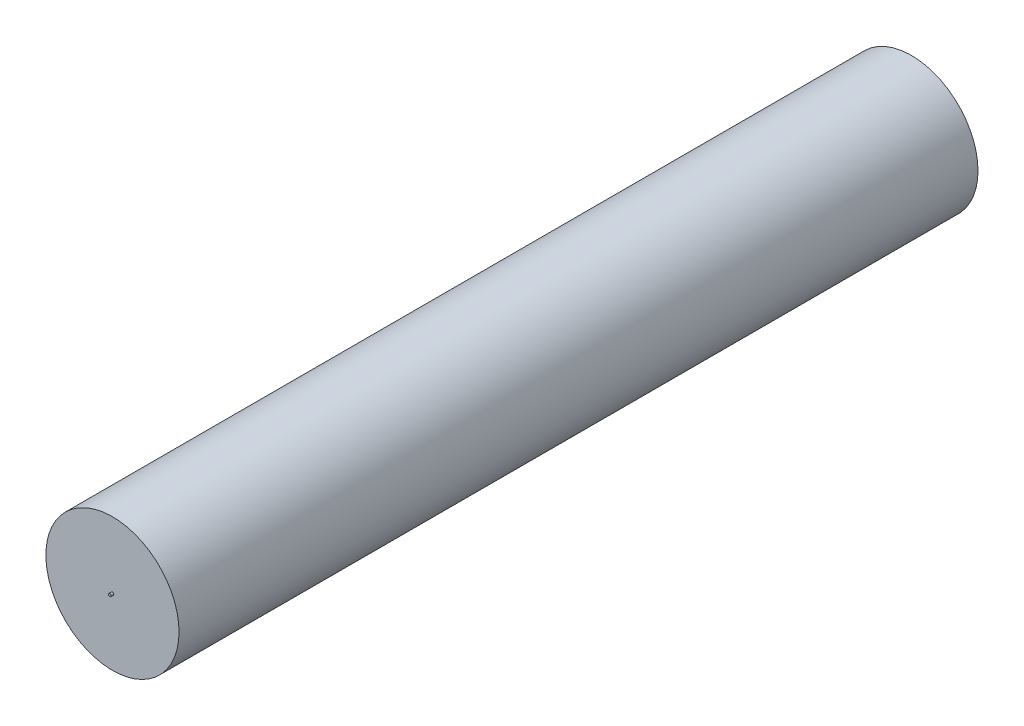
ISO-10303-21;
HEADER;
FILE_DESCRIPTION(('STEP AP214'),'2;1');
FILE_NAME('part.step','',(''),(''),'','','');
FILE_SCHEMA(('AUTOMOTIVE_DESIGN { 1 0 10303 214 1 1 1 1 }'));
ENDSEC;
DATA;
#1=APPLICATION_CONTEXT('core data for automotive mechanical design processes');
#2=APPLICATION_PROTOCOL_DEFINITION('international standard','automotive_design',2000,#1);
#3=PRODUCT_CONTEXT('',#1,'mechanical');
#4=PRODUCT('Part','Part','',(#3));
#5=PRODUCT_RELATED_PRODUCT_CATEGORY('part','',(#4));
#6=PRODUCT_DEFINITION_FORMATION('','',#4);
#7=PRODUCT_DEFINITION_CONTEXT('part definition',#1,'design');
#8=PRODUCT_DEFINITION('design','',#6,#7);
#9=PRODUCT_DEFINITION_SHAPE('','',#8);
#10=(LENGTH_UNIT() NAMED_UNIT(*) SI_UNIT(.MILLI.,.METRE.));
#11=(NAMED_UNIT(*) PLANE_ANGLE_UNIT() SI_UNIT($,.RADIAN.));
#12=(NAMED_UNIT(*) SI_UNIT($,.STERADIAN.) SOLID_ANGLE_UNIT());
#13=UNCERTAINTY_MEASURE_WITH_UNIT(LENGTH_MEASURE(1.E-05),#10,'distance_accuracy_value','');
#14=(GEOMETRIC_REPRESENTATION_CONTEXT(3) GLOBAL_UNCERTAINTY_ASSIGNED_CONTEXT((#13)) GLOBAL_UNIT_ASSIGNED_CONTEXT((#10,
#11,#12)) REPRESENTATION_CONTEXT('',''));
#15=CARTESIAN_POINT('',(0.,0.,0.));
#16=DIRECTION('',(0.,0.,1.));
#17=DIRECTION('',(1.,0.,0.));
#18=AXIS2_PLACEMENT_3D('',#15,#16,#17);
#19=CARTESIAN_POINT('',(0.,0.,-150.));
#20=DIRECTION('',(0.,0.,1.));
#21=DIRECTION('',(1.,0.,0.));
#22=AXIS2_PLACEMENT_3D('',#19,#20,#21);
#23=CYLINDRICAL_SURFACE('',#22,25.);
#24=CARTESIAN_POINT('',(0.,0.,-150.));
#25=DIRECTION('',(0.,0.,1.));
#26=DIRECTION('',(1.,0.,0.));
#27=AXIS2_PLACEMENT_3D('',#24,#25,#26);
#28=CIRCLE('',#27,25.);
#29=CARTESIAN_POINT('',(25.,0.,-150.));
#30=VERTEX_POINT('',#29);
#31=EDGE_CURVE('E10',#30,#30,#28,.T.);
#32=ORIENTED_EDGE('',*,*,#31,.T.);
#33=EDGE_LOOP('',(#32));
#34=FACE_BOUND('',#33,.T.);
#35=CARTESIAN_POINT('',(0.,0.,150.));
#36=DIRECTION('',(0.,0.,1.));
#37=DIRECTION('',(1.,0.,0.));
#38=AXIS2_PLACEMENT_3D('',#35,#36,#37);
#39=CIRCLE('',#38,25.);
#40=CARTESIAN_POINT('',(25.,0.,150.));
#41=VERTEX_POINT('',#40);
#42=EDGE_CURVE('E46',#41,#41,#39,.T.);
#43=ORIENTED_EDGE('',*,*,#42,.F.);
#44=EDGE_LOOP('',(#43));
#45=FACE_BOUND('',#44,.T.);
#46=ADVANCED_FACE('F39',(#34,#45),#23,.T.);
#47=CARTESIAN_POINT('',(0.,0.,-150.));
#48=DIRECTION('',(0.,0.,1.));
#49=DIRECTION('',(1.,0.,0.));
#50=AXIS2_PLACEMENT_3D('',#47,#48,#49);
#51=PLANE('',#50);
#52=ORIENTED_EDGE('',*,*,#31,.F.);
#53=EDGE_LOOP('',(#52));
#54=FACE_BOUND('',#53,.T.);
#55=ADVANCED_FACE('F67',(#54),#51,.F.);
#56=CARTESIAN_POINT('',(0.,0.,150.));
#57=DIRECTION('',(0.,0.,1.));
#58=DIRECTION('',(1.,0.,0.));
#59=AXIS2_PLACEMENT_3D('',#56,#57,#58);
#60=PLANE('',#59);
#61=CARTESIAN_POINT('',(0.,0.,150.));
#62=DIRECTION('',(0.,0.,1.));
#63=DIRECTION('',(1.,0.,0.));
#64=AXIS2_PLACEMENT_3D('',#61,#62,#63);
#65=CIRCLE('',#64,0.5);
#66=CARTESIAN_POINT('',(0.5,0.,150.));
#67=VERTEX_POINT('',#66);
#68=EDGE_CURVE('E56',#67,#67,#65,.T.);
#69=ORIENTED_EDGE('',*,*,#68,.F.);
#70=EDGE_LOOP('',(#69));
#71=FACE_BOUND('',#70,.T.);
#72=ORIENTED_EDGE('',*,*,#42,.T.);
#73=EDGE_LOOP('',(#72));
#74=FACE_BOUND('',#73,.T.);
#75=ADVANCED_FACE('F65',(#71,#74),#60,.T.);
#76=CARTESIAN_POINT('',(0.,0.,151.));
#77=DIRECTION('',(0.,0.,-1.));
#78=DIRECTION('',(-1.,0.,0.));
#79=AXIS2_PLACEMENT_3D('',#76,#77,#78);
#80=CYLINDRICAL_SURFACE('',#79,0.5);
#81=CARTESIAN_POINT('',(0.,0.,151.));
#82=DIRECTION('',(0.,0.,1.));
#83=DIRECTION('',(1.,0.,0.));
#84=AXIS2_PLACEMENT_3D('',#81,#82,#83);
#85=CIRCLE('',#84,0.5);
#86=CARTESIAN_POINT('',(0.5,0.,151.));
#87=VERTEX_POINT('',#86);
#88=EDGE_CURVE('E51',#87,#87,#85,.T.);
#89=ORIENTED_EDGE('',*,*,#88,.F.);
#90=EDGE_LOOP('',(#89));
#91=FACE_BOUND('',#90,.T.);
#92=ORIENTED_EDGE('',*,*,#68,.T.);
#93=EDGE_LOOP('',(#92));
#94=FACE_BOUND('',#93,.T.);
#95=ADVANCED_FACE('F63',(#91,#94),#80,.T.);
#96=CARTESIAN_POINT('',(0.,0.,151.));
#97=DIRECTION('',(0.,0.,1.));
#98=DIRECTION('',(1.,0.,0.));
#99=AXIS2_PLACEMENT_3D('',#96,#97,#98);
#100=PLANE('',#99);
#101=ORIENTED_EDGE('',*,*,#88,.T.);
#102=EDGE_LOOP('',(#101));
#103=FACE_BOUND('',#102,.T.);
#104=ADVANCED_FACE('F73',(#103),#100,.T.);
#105=CLOSED_SHELL('',(#46,#55,#75,#95,#104));
#106=MANIFOLD_SOLID_BREP('B2',#105);
#107=ADVANCED_BREP_SHAPE_REPRESENTATION('',(#18,#106),#14);
#108=SHAPE_DEFINITION_REPRESENTATION(#9,#107);
ENDSEC;
END-ISO-10303-21;
